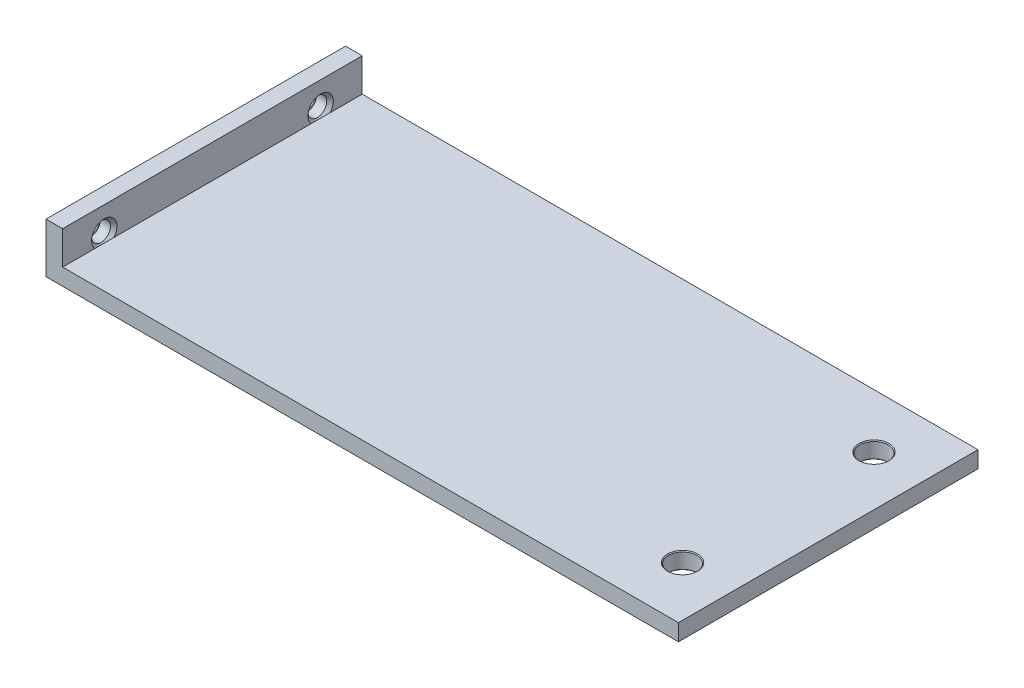
ISO-10303-21;
HEADER;
FILE_DESCRIPTION(('STEP AP214'),'2;1');
FILE_NAME('part.step','',(''),(''),'','','');
FILE_SCHEMA(('AUTOMOTIVE_DESIGN { 1 0 10303 214 1 1 1 1 }'));
ENDSEC;
DATA;
#1=APPLICATION_CONTEXT('core data for automotive mechanical design processes');
#2=APPLICATION_PROTOCOL_DEFINITION('international standard','automotive_design',2000,#1);
#3=PRODUCT_CONTEXT('',#1,'mechanical');
#4=PRODUCT('Part','Part','',(#3));
#5=PRODUCT_RELATED_PRODUCT_CATEGORY('part','',(#4));
#6=PRODUCT_DEFINITION_FORMATION('','',#4);
#7=PRODUCT_DEFINITION_CONTEXT('part definition',#1,'design');
#8=PRODUCT_DEFINITION('design','',#6,#7);
#9=PRODUCT_DEFINITION_SHAPE('','',#8);
#10=(LENGTH_UNIT() NAMED_UNIT(*) SI_UNIT(.MILLI.,.METRE.));
#11=(NAMED_UNIT(*) PLANE_ANGLE_UNIT() SI_UNIT($,.RADIAN.));
#12=(NAMED_UNIT(*) SI_UNIT($,.STERADIAN.) SOLID_ANGLE_UNIT());
#13=UNCERTAINTY_MEASURE_WITH_UNIT(LENGTH_MEASURE(1.E-05),#10,'distance_accuracy_value','');
#14=(GEOMETRIC_REPRESENTATION_CONTEXT(3) GLOBAL_UNCERTAINTY_ASSIGNED_CONTEXT((#13)) GLOBAL_UNIT_ASSIGNED_CONTEXT((#10,
#11,#12)) REPRESENTATION_CONTEXT('',''));
#15=CARTESIAN_POINT('',(0.,0.,0.));
#16=DIRECTION('',(0.,0.,1.));
#17=DIRECTION('',(1.,0.,0.));
#18=AXIS2_PLACEMENT_3D('',#15,#16,#17);
#19=CARTESIAN_POINT('',(40.,20.,36.));
#20=DIRECTION('',(0.,0.,-1.));
#21=DIRECTION('',(-1.,0.,0.));
#22=AXIS2_PLACEMENT_3D('',#19,#20,#21);
#23=PLANE('',#22);
#24=DIRECTION('',(0.,-1.,0.));
#25=VECTOR('',#24,1.);
#26=CARTESIAN_POINT('',(-38.,-18.,36.));
#27=LINE('',#26,#25);
#28=CARTESIAN_POINT('',(-38.,-14.,36.));
#29=VERTEX_POINT('',#28);
#30=CARTESIAN_POINT('',(-38.,-18.,36.));
#31=VERTEX_POINT('',#30);
#32=EDGE_CURVE('E147',#29,#31,#27,.T.);
#33=ORIENTED_EDGE('',*,*,#32,.F.);
#34=DIRECTION('',(1.,0.,0.));
#35=VECTOR('',#34,1.);
#36=CARTESIAN_POINT('',(0.,-14.,36.));
#37=LINE('',#36,#35);
#38=CARTESIAN_POINT('',(-40.,-14.,36.));
#39=VERTEX_POINT('',#38);
#40=EDGE_CURVE('E168',#39,#29,#37,.T.);
#41=ORIENTED_EDGE('',*,*,#40,.F.);
#42=DIRECTION('',(0.,-1.,0.));
#43=VECTOR('',#42,1.);
#44=CARTESIAN_POINT('',(-40.,-20.,36.));
#45=LINE('',#44,#43);
#46=CARTESIAN_POINT('',(-40.,-20.,36.));
#47=VERTEX_POINT('',#46);
#48=EDGE_CURVE('E124',#39,#47,#45,.T.);
#49=ORIENTED_EDGE('',*,*,#48,.T.);
#50=DIRECTION('',(1.,0.,0.));
#51=VECTOR('',#50,1.);
#52=CARTESIAN_POINT('',(-40.,-20.,36.));
#53=LINE('',#52,#51);
#54=CARTESIAN_POINT('',(36.,-20.,36.));
#55=VERTEX_POINT('',#54);
#56=EDGE_CURVE('E126',#47,#55,#53,.T.);
#57=ORIENTED_EDGE('',*,*,#56,.T.);
#58=DIRECTION('',(0.,-1.,0.));
#59=VECTOR('',#58,1.);
#60=CARTESIAN_POINT('',(36.,-69.7115298799416,36.));
#61=LINE('',#60,#59);
#62=CARTESIAN_POINT('',(36.,-18.,36.));
#63=VERTEX_POINT('',#62);
#64=EDGE_CURVE('E181',#63,#55,#61,.T.);
#65=ORIENTED_EDGE('',*,*,#64,.F.);
#66=DIRECTION('',(1.,0.,0.));
#67=VECTOR('',#66,1.);
#68=CARTESIAN_POINT('',(-38.,-18.,36.));
#69=LINE('',#68,#67);
#70=EDGE_CURVE('E152',#31,#63,#69,.T.);
#71=ORIENTED_EDGE('',*,*,#70,.F.);
#72=EDGE_LOOP('',(#33,#41,#49,#57,#65,#71));
#73=FACE_BOUND('',#72,.T.);
#74=ADVANCED_FACE('F31',(#73),#23,.F.);
#75=CARTESIAN_POINT('',(40.,20.,0.));
#76=DIRECTION('',(0.,0.,-1.));
#77=DIRECTION('',(-1.,0.,0.));
#78=AXIS2_PLACEMENT_3D('',#75,#76,#77);
#79=PLANE('',#78);
#80=DIRECTION('',(1.,0.,0.));
#81=VECTOR('',#80,1.);
#82=CARTESIAN_POINT('',(0.,-14.,0.));
#83=LINE('',#82,#81);
#84=CARTESIAN_POINT('',(-40.,-14.,0.));
#85=VERTEX_POINT('',#84);
#86=CARTESIAN_POINT('',(-38.,-14.,0.));
#87=VERTEX_POINT('',#86);
#88=EDGE_CURVE('E173',#85,#87,#83,.T.);
#89=ORIENTED_EDGE('',*,*,#88,.T.);
#90=DIRECTION('',(0.,-1.,0.));
#91=VECTOR('',#90,1.);
#92=CARTESIAN_POINT('',(-38.,-18.,0.));
#93=LINE('',#92,#91);
#94=CARTESIAN_POINT('',(-38.,-18.,0.));
#95=VERTEX_POINT('',#94);
#96=EDGE_CURVE('E156',#87,#95,#93,.T.);
#97=ORIENTED_EDGE('',*,*,#96,.T.);
#98=DIRECTION('',(1.,0.,0.));
#99=VECTOR('',#98,1.);
#100=CARTESIAN_POINT('',(-38.,-18.,0.));
#101=LINE('',#100,#99);
#102=CARTESIAN_POINT('',(36.,-18.,0.));
#103=VERTEX_POINT('',#102);
#104=EDGE_CURVE('E122',#95,#103,#101,.T.);
#105=ORIENTED_EDGE('',*,*,#104,.T.);
#106=DIRECTION('',(0.,-1.,0.));
#107=VECTOR('',#106,1.);
#108=CARTESIAN_POINT('',(36.,-69.7115298799416,0.));
#109=LINE('',#108,#107);
#110=CARTESIAN_POINT('',(36.,-20.,0.));
#111=VERTEX_POINT('',#110);
#112=EDGE_CURVE('E176',#103,#111,#109,.T.);
#113=ORIENTED_EDGE('',*,*,#112,.T.);
#114=DIRECTION('',(1.,0.,0.));
#115=VECTOR('',#114,1.);
#116=CARTESIAN_POINT('',(-40.,-20.,0.));
#117=LINE('',#116,#115);
#118=CARTESIAN_POINT('',(-40.,-20.,0.));
#119=VERTEX_POINT('',#118);
#120=EDGE_CURVE('E127',#119,#111,#117,.T.);
#121=ORIENTED_EDGE('',*,*,#120,.F.);
#122=DIRECTION('',(0.,-1.,0.));
#123=VECTOR('',#122,1.);
#124=CARTESIAN_POINT('',(-40.,-20.,0.));
#125=LINE('',#124,#123);
#126=EDGE_CURVE('E121',#85,#119,#125,.T.);
#127=ORIENTED_EDGE('',*,*,#126,.F.);
#128=EDGE_LOOP('',(#89,#97,#105,#113,#121,#127));
#129=FACE_BOUND('',#128,.T.);
#130=ADVANCED_FACE('F272',(#129),#79,.T.);
#131=CARTESIAN_POINT('',(-40.,-20.,36.));
#132=DIRECTION('',(1.,0.,0.));
#133=DIRECTION('',(0.,0.,-1.));
#134=AXIS2_PLACEMENT_3D('',#131,#132,#133);
#135=PLANE('',#134);
#136=CARTESIAN_POINT('',(-40.,-17.,5.));
#137=DIRECTION('',(-1.,0.,0.));
#138=DIRECTION('',(0.,0.,1.));
#139=AXIS2_PLACEMENT_3D('',#136,#137,#138);
#140=CIRCLE('',#139,1.524);
#141=CARTESIAN_POINT('',(-40.,-17.,6.524));
#142=VERTEX_POINT('',#141);
#143=EDGE_CURVE('E103',#142,#142,#140,.T.);
#144=ORIENTED_EDGE('',*,*,#143,.F.);
#145=EDGE_LOOP('',(#144));
#146=FACE_BOUND('',#145,.T.);
#147=CARTESIAN_POINT('',(-40.,-17.,31.));
#148=DIRECTION('',(-1.,0.,0.));
#149=DIRECTION('',(0.,0.,1.));
#150=AXIS2_PLACEMENT_3D('',#147,#148,#149);
#151=CIRCLE('',#150,1.524);
#152=CARTESIAN_POINT('',(-40.,-17.,32.524));
#153=VERTEX_POINT('',#152);
#154=EDGE_CURVE('E140',#153,#153,#151,.T.);
#155=ORIENTED_EDGE('',*,*,#154,.F.);
#156=EDGE_LOOP('',(#155));
#157=FACE_BOUND('',#156,.T.);
#158=ORIENTED_EDGE('',*,*,#48,.F.);
#159=DIRECTION('',(0.,0.,1.));
#160=VECTOR('',#159,1.);
#161=CARTESIAN_POINT('',(-40.,-14.,0.));
#162=LINE('',#161,#160);
#163=EDGE_CURVE('E163',#85,#39,#162,.T.);
#164=ORIENTED_EDGE('',*,*,#163,.F.);
#165=ORIENTED_EDGE('',*,*,#126,.T.);
#166=DIRECTION('',(0.,0.,-1.));
#167=VECTOR('',#166,1.);
#168=CARTESIAN_POINT('',(-40.,-20.,36.));
#169=LINE('',#168,#167);
#170=EDGE_CURVE('E130',#47,#119,#169,.T.);
#171=ORIENTED_EDGE('',*,*,#170,.F.);
#172=EDGE_LOOP('',(#158,#164,#165,#171));
#173=FACE_BOUND('',#172,.T.);
#174=ADVANCED_FACE('F33',(#146,#157,#173),#135,.F.);
#175=CARTESIAN_POINT('',(-40.,-20.,36.));
#176=DIRECTION('',(0.,1.,0.));
#177=DIRECTION('',(0.,0.,1.));
#178=AXIS2_PLACEMENT_3D('',#175,#176,#177);
#179=PLANE('',#178);
#180=CARTESIAN_POINT('',(30.,-20.,6.5));
#181=DIRECTION('',(0.,1.,0.));
#182=DIRECTION('',(0.,0.,1.));
#183=AXIS2_PLACEMENT_3D('',#180,#181,#182);
#184=CIRCLE('',#183,1.8);
#185=CARTESIAN_POINT('',(30.,-20.,8.3));
#186=VERTEX_POINT('',#185);
#187=EDGE_CURVE('E228',#186,#186,#184,.T.);
#188=ORIENTED_EDGE('',*,*,#187,.T.);
#189=EDGE_LOOP('',(#188));
#190=FACE_BOUND('',#189,.T.);
#191=CARTESIAN_POINT('',(30.,-20.,29.5));
#192=DIRECTION('',(0.,1.,0.));
#193=DIRECTION('',(0.,0.,1.));
#194=AXIS2_PLACEMENT_3D('',#191,#192,#193);
#195=CIRCLE('',#194,1.8);
#196=CARTESIAN_POINT('',(30.,-20.,31.3));
#197=VERTEX_POINT('',#196);
#198=EDGE_CURVE('E216',#197,#197,#195,.T.);
#199=ORIENTED_EDGE('',*,*,#198,.T.);
#200=EDGE_LOOP('',(#199));
#201=FACE_BOUND('',#200,.T.);
#202=ORIENTED_EDGE('',*,*,#120,.T.);
#203=DIRECTION('',(0.,0.,1.));
#204=VECTOR('',#203,1.);
#205=CARTESIAN_POINT('',(36.,-20.,0.));
#206=LINE('',#205,#204);
#207=EDGE_CURVE('E165',#111,#55,#206,.T.);
#208=ORIENTED_EDGE('',*,*,#207,.T.);
#209=ORIENTED_EDGE('',*,*,#56,.F.);
#210=ORIENTED_EDGE('',*,*,#170,.T.);
#211=EDGE_LOOP('',(#202,#208,#209,#210));
#212=FACE_BOUND('',#211,.T.);
#213=ADVANCED_FACE('F232',(#190,#201,#212),#179,.F.);
#214=CARTESIAN_POINT('',(-38.,-18.,36.));
#215=DIRECTION('',(1.,0.,0.));
#216=DIRECTION('',(0.,0.,-1.));
#217=AXIS2_PLACEMENT_3D('',#214,#215,#216);
#218=PLANE('',#217);
#219=CARTESIAN_POINT('',(-38.,-17.,5.));
#220=DIRECTION('',(1.,0.,0.));
#221=DIRECTION('',(0.,0.,-1.));
#222=AXIS2_PLACEMENT_3D('',#219,#220,#221);
#223=CIRCLE('',#222,1.524);
#224=CARTESIAN_POINT('',(-38.,-18.,3.84996695699645));
#225=VERTEX_POINT('',#224);
#226=CARTESIAN_POINT('',(-38.,-18.,6.15003304300355));
#227=VERTEX_POINT('',#226);
#228=EDGE_CURVE('E11',#225,#227,#223,.T.);
#229=ORIENTED_EDGE('',*,*,#228,.F.);
#230=DIRECTION('',(0.,0.,-1.));
#231=VECTOR('',#230,1.);
#232=CARTESIAN_POINT('',(-38.,-18.,36.));
#233=LINE('',#232,#231);
#234=EDGE_CURVE('E112',#225,#95,#233,.T.);
#235=ORIENTED_EDGE('',*,*,#234,.T.);
#236=ORIENTED_EDGE('',*,*,#96,.F.);
#237=DIRECTION('',(0.,0.,1.));
#238=VECTOR('',#237,1.);
#239=CARTESIAN_POINT('',(-38.,-14.,0.));
#240=LINE('',#239,#238);
#241=EDGE_CURVE('E149',#87,#29,#240,.T.);
#242=ORIENTED_EDGE('',*,*,#241,.T.);
#243=ORIENTED_EDGE('',*,*,#32,.T.);
#244=CARTESIAN_POINT('',(-38.,-18.,32.1500330430035));
#245=VERTEX_POINT('',#244);
#246=EDGE_CURVE('E118',#31,#245,#233,.T.);
#247=ORIENTED_EDGE('',*,*,#246,.T.);
#248=CARTESIAN_POINT('',(-38.,-17.,31.));
#249=DIRECTION('',(1.,0.,0.));
#250=DIRECTION('',(0.,0.,-1.));
#251=AXIS2_PLACEMENT_3D('',#248,#249,#250);
#252=CIRCLE('',#251,1.524);
#253=CARTESIAN_POINT('',(-38.,-18.,29.8499669569965));
#254=VERTEX_POINT('',#253);
#255=EDGE_CURVE('E39',#254,#245,#252,.T.);
#256=ORIENTED_EDGE('',*,*,#255,.F.);
#257=EDGE_CURVE('E110',#254,#227,#233,.T.);
#258=ORIENTED_EDGE('',*,*,#257,.T.);
#259=EDGE_LOOP('',(#229,#235,#236,#242,#243,#247,#256,#258));
#260=FACE_BOUND('',#259,.T.);
#261=ADVANCED_FACE('F115',(#260),#218,.T.);
#262=CARTESIAN_POINT('',(-38.,-18.,36.));
#263=DIRECTION('',(0.,1.,0.));
#264=DIRECTION('',(0.,0.,1.));
#265=AXIS2_PLACEMENT_3D('',#262,#263,#264);
#266=PLANE('',#265);
#267=CARTESIAN_POINT('',(30.,-18.,6.5));
#268=DIRECTION('',(0.,1.,0.));
#269=DIRECTION('',(0.,0.,1.));
#270=AXIS2_PLACEMENT_3D('',#267,#268,#269);
#271=CIRCLE('',#270,1.8);
#272=CARTESIAN_POINT('',(30.,-18.,8.3));
#273=VERTEX_POINT('',#272);
#274=EDGE_CURVE('E225',#273,#273,#271,.T.);
#275=ORIENTED_EDGE('',*,*,#274,.F.);
#276=EDGE_LOOP('',(#275));
#277=FACE_BOUND('',#276,.T.);
#278=CARTESIAN_POINT('',(30.,-18.,29.5));
#279=DIRECTION('',(0.,1.,0.));
#280=DIRECTION('',(0.,0.,1.));
#281=AXIS2_PLACEMENT_3D('',#278,#279,#280);
#282=CIRCLE('',#281,1.8);
#283=CARTESIAN_POINT('',(30.,-18.,31.3));
#284=VERTEX_POINT('',#283);
#285=EDGE_CURVE('E211',#284,#284,#282,.T.);
#286=ORIENTED_EDGE('',*,*,#285,.F.);
#287=EDGE_LOOP('',(#286));
#288=FACE_BOUND('',#287,.T.);
#289=DIRECTION('',(0.,0.,1.));
#290=VECTOR('',#289,1.);
#291=CARTESIAN_POINT('',(36.,-18.,0.));
#292=LINE('',#291,#290);
#293=EDGE_CURVE('E158',#103,#63,#292,.T.);
#294=ORIENTED_EDGE('',*,*,#293,.F.);
#295=ORIENTED_EDGE('',*,*,#104,.F.);
#296=ORIENTED_EDGE('',*,*,#234,.F.);
#297=EDGE_CURVE('E101',#227,#225,#233,.T.);
#298=ORIENTED_EDGE('',*,*,#297,.F.);
#299=ORIENTED_EDGE('',*,*,#257,.F.);
#300=EDGE_CURVE('E117',#245,#254,#233,.T.);
#301=ORIENTED_EDGE('',*,*,#300,.F.);
#302=ORIENTED_EDGE('',*,*,#246,.F.);
#303=ORIENTED_EDGE('',*,*,#70,.T.);
#304=EDGE_LOOP('',(#294,#295,#296,#298,#299,#301,#302,#303));
#305=FACE_BOUND('',#304,.T.);
#306=ADVANCED_FACE('F108',(#277,#288,#305),#266,.T.);
#307=CARTESIAN_POINT('',(36.,-69.7115298799416,0.));
#308=DIRECTION('',(-1.,0.,0.));
#309=DIRECTION('',(0.,0.,1.));
#310=AXIS2_PLACEMENT_3D('',#307,#308,#309);
#311=PLANE('',#310);
#312=ORIENTED_EDGE('',*,*,#64,.T.);
#313=ORIENTED_EDGE('',*,*,#207,.F.);
#314=ORIENTED_EDGE('',*,*,#112,.F.);
#315=ORIENTED_EDGE('',*,*,#293,.T.);
#316=EDGE_LOOP('',(#312,#313,#314,#315));
#317=FACE_BOUND('',#316,.T.);
#318=ADVANCED_FACE('F256',(#317),#311,.F.);
#319=CARTESIAN_POINT('',(0.,-14.,0.));
#320=DIRECTION('',(0.,-1.,0.));
#321=DIRECTION('',(1.,0.,0.));
#322=AXIS2_PLACEMENT_3D('',#319,#320,#321);
#323=PLANE('',#322);
#324=ORIENTED_EDGE('',*,*,#40,.T.);
#325=ORIENTED_EDGE('',*,*,#241,.F.);
#326=ORIENTED_EDGE('',*,*,#88,.F.);
#327=ORIENTED_EDGE('',*,*,#163,.T.);
#328=EDGE_LOOP('',(#324,#325,#326,#327));
#329=FACE_BOUND('',#328,.T.);
#330=ADVANCED_FACE('F293',(#329),#323,.F.);
#331=CARTESIAN_POINT('',(-38.3937,-17.,31.));
#332=DIRECTION('',(1.,0.,0.));
#333=DIRECTION('',(0.,0.,-1.));
#334=AXIS2_PLACEMENT_3D('',#331,#332,#333);
#335=CONICAL_SURFACE('',#334,1.1303,0.785398163397442);
#336=CARTESIAN_POINT('',(-38.,-17.,31.));
#337=DIRECTION('',(1.,0.,0.));
#338=DIRECTION('',(0.,0.,-1.));
#339=AXIS2_PLACEMENT_3D('',#336,#337,#338);
#340=CIRCLE('',#339,1.524);
#341=EDGE_CURVE('E51',#254,#245,#340,.F.);
#342=ORIENTED_EDGE('',*,*,#341,.F.);
#343=ORIENTED_EDGE('',*,*,#255,.T.);
#344=EDGE_LOOP('',(#342,#343));
#345=FACE_BOUND('',#344,.T.);
#346=CARTESIAN_POINT('',(-38.3937,-17.,31.));
#347=DIRECTION('',(-1.,0.,0.));
#348=DIRECTION('',(0.,0.,1.));
#349=AXIS2_PLACEMENT_3D('',#346,#347,#348);
#350=CIRCLE('',#349,1.1303);
#351=CARTESIAN_POINT('',(-38.3937,-17.,32.1303));
#352=VERTEX_POINT('',#351);
#353=EDGE_CURVE('E139',#352,#352,#350,.T.);
#354=ORIENTED_EDGE('',*,*,#353,.T.);
#355=EDGE_LOOP('',(#354));
#356=FACE_BOUND('',#355,.T.);
#357=ADVANCED_FACE('F135',(#345,#356),#335,.F.);
#358=CARTESIAN_POINT('',(-40.,-17.,31.));
#359=DIRECTION('',(-1.,0.,0.));
#360=DIRECTION('',(0.,0.,1.));
#361=AXIS2_PLACEMENT_3D('',#358,#359,#360);
#362=CYLINDRICAL_SURFACE('',#361,1.1303);
#363=ORIENTED_EDGE('',*,*,#353,.F.);
#364=EDGE_LOOP('',(#363));
#365=FACE_BOUND('',#364,.T.);
#366=CARTESIAN_POINT('',(-39.6063,-17.,31.));
#367=DIRECTION('',(-1.,0.,0.));
#368=DIRECTION('',(0.,0.,1.));
#369=AXIS2_PLACEMENT_3D('',#366,#367,#368);
#370=CIRCLE('',#369,1.1303);
#371=CARTESIAN_POINT('',(-39.6063,-17.,32.1303));
#372=VERTEX_POINT('',#371);
#373=EDGE_CURVE('E182',#372,#372,#370,.T.);
#374=ORIENTED_EDGE('',*,*,#373,.T.);
#375=EDGE_LOOP('',(#374));
#376=FACE_BOUND('',#375,.T.);
#377=ADVANCED_FACE('F300',(#365,#376),#362,.F.);
#378=CARTESIAN_POINT('',(-40.,-17.,31.));
#379=DIRECTION('',(-1.,0.,0.));
#380=DIRECTION('',(0.,0.,1.));
#381=AXIS2_PLACEMENT_3D('',#378,#379,#380);
#382=CONICAL_SURFACE('',#381,1.524,0.78539816339745);
#383=ORIENTED_EDGE('',*,*,#373,.F.);
#384=EDGE_LOOP('',(#383));
#385=FACE_BOUND('',#384,.T.);
#386=ORIENTED_EDGE('',*,*,#154,.T.);
#387=EDGE_LOOP('',(#386));
#388=FACE_BOUND('',#387,.T.);
#389=ADVANCED_FACE('F306',(#385,#388),#382,.F.);
#390=CARTESIAN_POINT('',(-38.,-18.,36.));
#391=DIRECTION('',(1.,0.,0.));
#392=DIRECTION('',(0.,0.,-1.));
#393=AXIS2_PLACEMENT_3D('',#390,#391,#392);
#394=PLANE('',#393);
#395=ORIENTED_EDGE('',*,*,#300,.T.);
#396=ORIENTED_EDGE('',*,*,#341,.T.);
#397=EDGE_LOOP('',(#395,#396));
#398=FACE_BOUND('',#397,.T.);
#399=ADVANCED_FACE('F138',(#398),#394,.F.);
#400=CARTESIAN_POINT('',(-38.3937,-17.,5.));
#401=DIRECTION('',(1.,0.,0.));
#402=DIRECTION('',(0.,0.,-1.));
#403=AXIS2_PLACEMENT_3D('',#400,#401,#402);
#404=CONICAL_SURFACE('',#403,1.1303,0.785398163397442);
#405=CARTESIAN_POINT('',(-38.,-17.,5.));
#406=DIRECTION('',(1.,0.,0.));
#407=DIRECTION('',(0.,0.,-1.));
#408=AXIS2_PLACEMENT_3D('',#405,#406,#407);
#409=CIRCLE('',#408,1.524);
#410=EDGE_CURVE('E44',#225,#227,#409,.F.);
#411=ORIENTED_EDGE('',*,*,#410,.F.);
#412=ORIENTED_EDGE('',*,*,#228,.T.);
#413=EDGE_LOOP('',(#411,#412));
#414=FACE_BOUND('',#413,.T.);
#415=CARTESIAN_POINT('',(-38.3937,-17.,5.));
#416=DIRECTION('',(-1.,0.,0.));
#417=DIRECTION('',(0.,0.,1.));
#418=AXIS2_PLACEMENT_3D('',#415,#416,#417);
#419=CIRCLE('',#418,1.1303);
#420=CARTESIAN_POINT('',(-38.3937,-17.,6.1303));
#421=VERTEX_POINT('',#420);
#422=EDGE_CURVE('E102',#421,#421,#419,.T.);
#423=ORIENTED_EDGE('',*,*,#422,.T.);
#424=EDGE_LOOP('',(#423));
#425=FACE_BOUND('',#424,.T.);
#426=ADVANCED_FACE('F93',(#414,#425),#404,.F.);
#427=CARTESIAN_POINT('',(-40.,-17.,5.));
#428=DIRECTION('',(-1.,0.,0.));
#429=DIRECTION('',(0.,0.,1.));
#430=AXIS2_PLACEMENT_3D('',#427,#428,#429);
#431=CYLINDRICAL_SURFACE('',#430,1.1303);
#432=ORIENTED_EDGE('',*,*,#422,.F.);
#433=EDGE_LOOP('',(#432));
#434=FACE_BOUND('',#433,.T.);
#435=CARTESIAN_POINT('',(-39.6063,-17.,5.));
#436=DIRECTION('',(-1.,0.,0.));
#437=DIRECTION('',(0.,0.,1.));
#438=AXIS2_PLACEMENT_3D('',#435,#436,#437);
#439=CIRCLE('',#438,1.1303);
#440=CARTESIAN_POINT('',(-39.6063,-17.,6.1303));
#441=VERTEX_POINT('',#440);
#442=EDGE_CURVE('E191',#441,#441,#439,.T.);
#443=ORIENTED_EDGE('',*,*,#442,.T.);
#444=EDGE_LOOP('',(#443));
#445=FACE_BOUND('',#444,.T.);
#446=ADVANCED_FACE('F318',(#434,#445),#431,.F.);
#447=CARTESIAN_POINT('',(-40.,-17.,5.));
#448=DIRECTION('',(-1.,0.,0.));
#449=DIRECTION('',(0.,0.,1.));
#450=AXIS2_PLACEMENT_3D('',#447,#448,#449);
#451=CONICAL_SURFACE('',#450,1.524,0.78539816339745);
#452=ORIENTED_EDGE('',*,*,#442,.F.);
#453=EDGE_LOOP('',(#452));
#454=FACE_BOUND('',#453,.T.);
#455=ORIENTED_EDGE('',*,*,#143,.T.);
#456=EDGE_LOOP('',(#455));
#457=FACE_BOUND('',#456,.T.);
#458=ADVANCED_FACE('F315',(#454,#457),#451,.F.);
#459=CARTESIAN_POINT('',(-38.,-18.,36.));
#460=DIRECTION('',(1.,0.,0.));
#461=DIRECTION('',(0.,0.,-1.));
#462=AXIS2_PLACEMENT_3D('',#459,#460,#461);
#463=PLANE('',#462);
#464=ORIENTED_EDGE('',*,*,#297,.T.);
#465=ORIENTED_EDGE('',*,*,#410,.T.);
#466=EDGE_LOOP('',(#464,#465));
#467=FACE_BOUND('',#466,.T.);
#468=ADVANCED_FACE('F100',(#467),#463,.F.);
#469=CARTESIAN_POINT('',(30.,-19.9,29.5));
#470=DIRECTION('',(0.,-1.,0.));
#471=DIRECTION('',(0.,0.,-1.));
#472=AXIS2_PLACEMENT_3D('',#469,#470,#471);
#473=CONICAL_SURFACE('',#472,1.7,0.785398163397448);
#474=ORIENTED_EDGE('',*,*,#198,.F.);
#475=EDGE_LOOP('',(#474));
#476=FACE_BOUND('',#475,.T.);
#477=CARTESIAN_POINT('',(30.,-19.9,29.5));
#478=DIRECTION('',(0.,1.,0.));
#479=DIRECTION('',(0.,0.,1.));
#480=AXIS2_PLACEMENT_3D('',#477,#478,#479);
#481=CIRCLE('',#480,1.7);
#482=CARTESIAN_POINT('',(30.,-19.9,31.2));
#483=VERTEX_POINT('',#482);
#484=EDGE_CURVE('E203',#483,#483,#481,.T.);
#485=ORIENTED_EDGE('',*,*,#484,.T.);
#486=EDGE_LOOP('',(#485));
#487=FACE_BOUND('',#486,.T.);
#488=ADVANCED_FACE('F267',(#476,#487),#473,.F.);
#489=CARTESIAN_POINT('',(30.,-18.,29.5));
#490=DIRECTION('',(0.,1.,0.));
#491=DIRECTION('',(0.,0.,1.));
#492=AXIS2_PLACEMENT_3D('',#489,#490,#491);
#493=CYLINDRICAL_SURFACE('',#492,1.7);
#494=ORIENTED_EDGE('',*,*,#484,.F.);
#495=EDGE_LOOP('',(#494));
#496=FACE_BOUND('',#495,.T.);
#497=CARTESIAN_POINT('',(30.,-18.1,29.5));
#498=DIRECTION('',(0.,1.,0.));
#499=DIRECTION('',(0.,0.,1.));
#500=AXIS2_PLACEMENT_3D('',#497,#498,#499);
#501=CIRCLE('',#500,1.7);
#502=CARTESIAN_POINT('',(30.,-18.1,31.2));
#503=VERTEX_POINT('',#502);
#504=EDGE_CURVE('E207',#503,#503,#501,.T.);
#505=ORIENTED_EDGE('',*,*,#504,.T.);
#506=EDGE_LOOP('',(#505));
#507=FACE_BOUND('',#506,.T.);
#508=ADVANCED_FACE('F261',(#496,#507),#493,.F.);
#509=CARTESIAN_POINT('',(30.,-18.,29.5));
#510=DIRECTION('',(0.,1.,0.));
#511=DIRECTION('',(0.,0.,1.));
#512=AXIS2_PLACEMENT_3D('',#509,#510,#511);
#513=CONICAL_SURFACE('',#512,1.8,0.785398163397431);
#514=ORIENTED_EDGE('',*,*,#504,.F.);
#515=EDGE_LOOP('',(#514));
#516=FACE_BOUND('',#515,.T.);
#517=ORIENTED_EDGE('',*,*,#285,.T.);
#518=EDGE_LOOP('',(#517));
#519=FACE_BOUND('',#518,.T.);
#520=ADVANCED_FACE('F239',(#516,#519),#513,.F.);
#521=CARTESIAN_POINT('',(30.,-19.9,6.5));
#522=DIRECTION('',(0.,-1.,0.));
#523=DIRECTION('',(0.,0.,-1.));
#524=AXIS2_PLACEMENT_3D('',#521,#522,#523);
#525=CONICAL_SURFACE('',#524,1.7,0.785398163397448);
#526=ORIENTED_EDGE('',*,*,#187,.F.);
#527=EDGE_LOOP('',(#526));
#528=FACE_BOUND('',#527,.T.);
#529=CARTESIAN_POINT('',(30.,-19.9,6.5));
#530=DIRECTION('',(0.,1.,0.));
#531=DIRECTION('',(0.,0.,1.));
#532=AXIS2_PLACEMENT_3D('',#529,#530,#531);
#533=CIRCLE('',#532,1.7);
#534=CARTESIAN_POINT('',(30.,-19.9,8.2));
#535=VERTEX_POINT('',#534);
#536=EDGE_CURVE('E219',#535,#535,#533,.T.);
#537=ORIENTED_EDGE('',*,*,#536,.T.);
#538=EDGE_LOOP('',(#537));
#539=FACE_BOUND('',#538,.T.);
#540=ADVANCED_FACE('F235',(#528,#539),#525,.F.);
#541=CARTESIAN_POINT('',(30.,-18.,6.5));
#542=DIRECTION('',(0.,1.,0.));
#543=DIRECTION('',(0.,0.,1.));
#544=AXIS2_PLACEMENT_3D('',#541,#542,#543);
#545=CYLINDRICAL_SURFACE('',#544,1.7);
#546=ORIENTED_EDGE('',*,*,#536,.F.);
#547=EDGE_LOOP('',(#546));
#548=FACE_BOUND('',#547,.T.);
#549=CARTESIAN_POINT('',(30.,-18.1,6.5));
#550=DIRECTION('',(0.,1.,0.));
#551=DIRECTION('',(0.,0.,1.));
#552=AXIS2_PLACEMENT_3D('',#549,#550,#551);
#553=CIRCLE('',#552,1.7);
#554=CARTESIAN_POINT('',(30.,-18.1,8.2));
#555=VERTEX_POINT('',#554);
#556=EDGE_CURVE('E222',#555,#555,#553,.T.);
#557=ORIENTED_EDGE('',*,*,#556,.T.);
#558=EDGE_LOOP('',(#557));
#559=FACE_BOUND('',#558,.T.);
#560=ADVANCED_FACE('F238',(#548,#559),#545,.F.);
#561=CARTESIAN_POINT('',(30.,-18.,6.5));
#562=DIRECTION('',(0.,1.,0.));
#563=DIRECTION('',(0.,0.,1.));
#564=AXIS2_PLACEMENT_3D('',#561,#562,#563);
#565=CONICAL_SURFACE('',#564,1.8,0.785398163397431);
#566=ORIENTED_EDGE('',*,*,#556,.F.);
#567=EDGE_LOOP('',(#566));
#568=FACE_BOUND('',#567,.T.);
#569=ORIENTED_EDGE('',*,*,#274,.T.);
#570=EDGE_LOOP('',(#569));
#571=FACE_BOUND('',#570,.T.);
#572=ADVANCED_FACE('F245',(#568,#571),#565,.F.);
#573=CLOSED_SHELL('',(#74,#130,#174,#213,#261,#306,#318,#330,#357,#377,#389,#399,#426,#446,#458,
#468,#488,#508,#520,#540,#560,#572));
#574=MANIFOLD_SOLID_BREP('B2',#573);
#575=ADVANCED_BREP_SHAPE_REPRESENTATION('',(#18,#574),#14);
#576=SHAPE_DEFINITION_REPRESENTATION(#9,#575);
ENDSEC;
END-ISO-10303-21;
